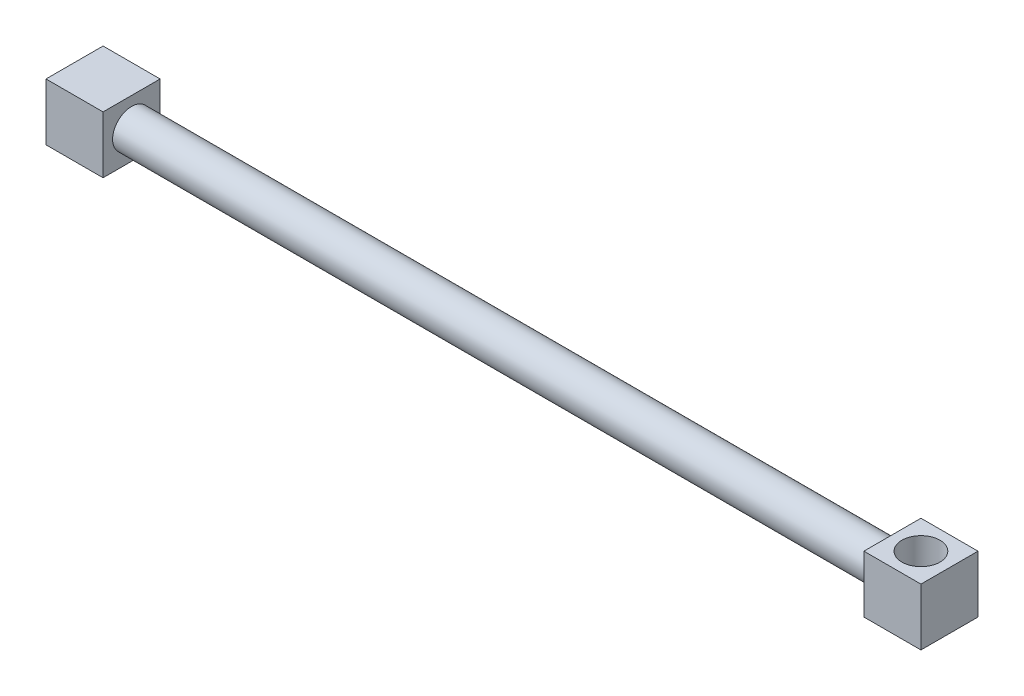
ISO-10303-21;
HEADER;
FILE_DESCRIPTION(('STEP AP214'),'2;1');
FILE_NAME('part.step','',(''),(''),'','','');
FILE_SCHEMA(('AUTOMOTIVE_DESIGN { 1 0 10303 214 1 1 1 1 }'));
ENDSEC;
DATA;
#1=APPLICATION_CONTEXT('core data for automotive mechanical design processes');
#2=APPLICATION_PROTOCOL_DEFINITION('international standard','automotive_design',2000,#1);
#3=PRODUCT_CONTEXT('',#1,'mechanical');
#4=PRODUCT('Part','Part','',(#3));
#5=PRODUCT_RELATED_PRODUCT_CATEGORY('part','',(#4));
#6=PRODUCT_DEFINITION_FORMATION('','',#4);
#7=PRODUCT_DEFINITION_CONTEXT('part definition',#1,'design');
#8=PRODUCT_DEFINITION('design','',#6,#7);
#9=PRODUCT_DEFINITION_SHAPE('','',#8);
#10=(LENGTH_UNIT() NAMED_UNIT(*) SI_UNIT(.MILLI.,.METRE.));
#11=(NAMED_UNIT(*) PLANE_ANGLE_UNIT() SI_UNIT($,.RADIAN.));
#12=(NAMED_UNIT(*) SI_UNIT($,.STERADIAN.) SOLID_ANGLE_UNIT());
#13=UNCERTAINTY_MEASURE_WITH_UNIT(LENGTH_MEASURE(1.E-05),#10,'distance_accuracy_value','');
#14=(GEOMETRIC_REPRESENTATION_CONTEXT(3) GLOBAL_UNCERTAINTY_ASSIGNED_CONTEXT((#13)) GLOBAL_UNIT_ASSIGNED_CONTEXT((#10,
#11,#12)) REPRESENTATION_CONTEXT('',''));
#15=CARTESIAN_POINT('',(0.,0.,0.));
#16=DIRECTION('',(0.,0.,1.));
#17=DIRECTION('',(1.,0.,0.));
#18=AXIS2_PLACEMENT_3D('',#15,#16,#17);
#19=CARTESIAN_POINT('',(30.,15.,-15.));
#20=DIRECTION('',(0.,0.,1.));
#21=DIRECTION('',(0.,-1.,0.));
#22=AXIS2_PLACEMENT_3D('',#19,#20,#21);
#23=PLANE('',#22);
#24=DIRECTION('',(0.,1.,0.));
#25=VECTOR('',#24,1.);
#26=CARTESIAN_POINT('',(0.,15.,-15.));
#27=LINE('',#26,#25);
#28=CARTESIAN_POINT('',(0.,-15.,-15.));
#29=VERTEX_POINT('',#28);
#30=CARTESIAN_POINT('',(0.,15.,-15.));
#31=VERTEX_POINT('',#30);
#32=EDGE_CURVE('E149',#29,#31,#27,.T.);
#33=ORIENTED_EDGE('',*,*,#32,.T.);
#34=DIRECTION('',(-1.,0.,0.));
#35=VECTOR('',#34,1.);
#36=CARTESIAN_POINT('',(30.,15.,-15.));
#37=LINE('',#36,#35);
#38=CARTESIAN_POINT('',(30.,15.,-15.));
#39=VERTEX_POINT('',#38);
#40=EDGE_CURVE('E42',#39,#31,#37,.T.);
#41=ORIENTED_EDGE('',*,*,#40,.F.);
#42=DIRECTION('',(0.,1.,0.));
#43=VECTOR('',#42,1.);
#44=CARTESIAN_POINT('',(30.,15.,-15.));
#45=LINE('',#44,#43);
#46=CARTESIAN_POINT('',(30.,-15.,-15.));
#47=VERTEX_POINT('',#46);
#48=EDGE_CURVE('E155',#47,#39,#45,.T.);
#49=ORIENTED_EDGE('',*,*,#48,.F.);
#50=DIRECTION('',(-1.,0.,0.));
#51=VECTOR('',#50,1.);
#52=CARTESIAN_POINT('',(30.,-15.,-15.));
#53=LINE('',#52,#51);
#54=EDGE_CURVE('E165',#47,#29,#53,.T.);
#55=ORIENTED_EDGE('',*,*,#54,.T.);
#56=EDGE_LOOP('',(#33,#41,#49,#55));
#57=FACE_BOUND('',#56,.T.);
#58=ADVANCED_FACE('F39',(#57),#23,.F.);
#59=CARTESIAN_POINT('',(30.,15.,15.));
#60=DIRECTION('',(0.,-1.,0.));
#61=DIRECTION('',(0.,0.,-1.));
#62=AXIS2_PLACEMENT_3D('',#59,#60,#61);
#63=PLANE('',#62);
#64=DIRECTION('',(0.,0.,1.));
#65=VECTOR('',#64,1.);
#66=CARTESIAN_POINT('',(0.,15.,15.));
#67=LINE('',#66,#65);
#68=CARTESIAN_POINT('',(0.,15.,15.));
#69=VERTEX_POINT('',#68);
#70=EDGE_CURVE('E169',#31,#69,#67,.T.);
#71=ORIENTED_EDGE('',*,*,#70,.T.);
#72=DIRECTION('',(-1.,0.,0.));
#73=VECTOR('',#72,1.);
#74=CARTESIAN_POINT('',(30.,15.,15.));
#75=LINE('',#74,#73);
#76=CARTESIAN_POINT('',(30.,15.,15.));
#77=VERTEX_POINT('',#76);
#78=EDGE_CURVE('E180',#77,#69,#75,.T.);
#79=ORIENTED_EDGE('',*,*,#78,.F.);
#80=DIRECTION('',(0.,0.,1.));
#81=VECTOR('',#80,1.);
#82=CARTESIAN_POINT('',(30.,15.,15.));
#83=LINE('',#82,#81);
#84=EDGE_CURVE('E89',#39,#77,#83,.T.);
#85=ORIENTED_EDGE('',*,*,#84,.F.);
#86=ORIENTED_EDGE('',*,*,#40,.T.);
#87=EDGE_LOOP('',(#71,#79,#85,#86));
#88=FACE_BOUND('',#87,.T.);
#89=ADVANCED_FACE('F185',(#88),#63,.F.);
#90=CARTESIAN_POINT('',(30.,15.,15.));
#91=DIRECTION('',(0.,0.,-1.));
#92=DIRECTION('',(0.,1.,0.));
#93=AXIS2_PLACEMENT_3D('',#90,#91,#92);
#94=PLANE('',#93);
#95=DIRECTION('',(0.,-1.,0.));
#96=VECTOR('',#95,1.);
#97=CARTESIAN_POINT('',(0.,15.,15.));
#98=LINE('',#97,#96);
#99=CARTESIAN_POINT('',(0.,-15.,15.));
#100=VERTEX_POINT('',#99);
#101=EDGE_CURVE('E75',#69,#100,#98,.T.);
#102=ORIENTED_EDGE('',*,*,#101,.T.);
#103=DIRECTION('',(-1.,0.,0.));
#104=VECTOR('',#103,1.);
#105=CARTESIAN_POINT('',(30.,-15.,15.));
#106=LINE('',#105,#104);
#107=CARTESIAN_POINT('',(30.,-15.,15.));
#108=VERTEX_POINT('',#107);
#109=EDGE_CURVE('E178',#108,#100,#106,.T.);
#110=ORIENTED_EDGE('',*,*,#109,.F.);
#111=DIRECTION('',(0.,-1.,0.));
#112=VECTOR('',#111,1.);
#113=CARTESIAN_POINT('',(30.,15.,15.));
#114=LINE('',#113,#112);
#115=EDGE_CURVE('E160',#77,#108,#114,.T.);
#116=ORIENTED_EDGE('',*,*,#115,.F.);
#117=ORIENTED_EDGE('',*,*,#78,.T.);
#118=EDGE_LOOP('',(#102,#110,#116,#117));
#119=FACE_BOUND('',#118,.T.);
#120=ADVANCED_FACE('F209',(#119),#94,.F.);
#121=CARTESIAN_POINT('',(30.,-15.,15.));
#122=DIRECTION('',(0.,1.,0.));
#123=DIRECTION('',(0.,0.,1.));
#124=AXIS2_PLACEMENT_3D('',#121,#122,#123);
#125=PLANE('',#124);
#126=DIRECTION('',(0.,0.,-1.));
#127=VECTOR('',#126,1.);
#128=CARTESIAN_POINT('',(0.,-15.,15.));
#129=LINE('',#128,#127);
#130=EDGE_CURVE('E81',#100,#29,#129,.T.);
#131=ORIENTED_EDGE('',*,*,#130,.T.);
#132=ORIENTED_EDGE('',*,*,#54,.F.);
#133=DIRECTION('',(0.,0.,-1.));
#134=VECTOR('',#133,1.);
#135=CARTESIAN_POINT('',(30.,-15.,15.));
#136=LINE('',#135,#134);
#137=EDGE_CURVE('E57',#108,#47,#136,.T.);
#138=ORIENTED_EDGE('',*,*,#137,.F.);
#139=ORIENTED_EDGE('',*,*,#109,.T.);
#140=EDGE_LOOP('',(#131,#132,#138,#139));
#141=FACE_BOUND('',#140,.T.);
#142=ADVANCED_FACE('F201',(#141),#125,.F.);
#143=CARTESIAN_POINT('',(30.,0.,0.));
#144=DIRECTION('',(1.,0.,0.));
#145=DIRECTION('',(0.,0.,-1.));
#146=AXIS2_PLACEMENT_3D('',#143,#144,#145);
#147=PLANE('',#146);
#148=CARTESIAN_POINT('',(30.,0.,0.));
#149=DIRECTION('',(1.,0.,0.));
#150=DIRECTION('',(0.,0.,-1.));
#151=AXIS2_PLACEMENT_3D('',#148,#149,#150);
#152=CIRCLE('',#151,10.);
#153=CARTESIAN_POINT('',(30.,0.,-10.));
#154=VERTEX_POINT('',#153);
#155=EDGE_CURVE('E11',#154,#154,#152,.T.);
#156=ORIENTED_EDGE('',*,*,#155,.F.);
#157=EDGE_LOOP('',(#156));
#158=FACE_BOUND('',#157,.T.);
#159=ORIENTED_EDGE('',*,*,#48,.T.);
#160=ORIENTED_EDGE('',*,*,#84,.T.);
#161=ORIENTED_EDGE('',*,*,#115,.T.);
#162=ORIENTED_EDGE('',*,*,#137,.T.);
#163=EDGE_LOOP('',(#159,#160,#161,#162));
#164=FACE_BOUND('',#163,.T.);
#165=ADVANCED_FACE('F193',(#158,#164),#147,.T.);
#166=CARTESIAN_POINT('',(0.,0.,0.));
#167=DIRECTION('',(1.,0.,0.));
#168=DIRECTION('',(0.,0.,-1.));
#169=AXIS2_PLACEMENT_3D('',#166,#167,#168);
#170=PLANE('',#169);
#171=ORIENTED_EDGE('',*,*,#32,.F.);
#172=ORIENTED_EDGE('',*,*,#130,.F.);
#173=ORIENTED_EDGE('',*,*,#101,.F.);
#174=ORIENTED_EDGE('',*,*,#70,.F.);
#175=EDGE_LOOP('',(#171,#172,#173,#174));
#176=FACE_BOUND('',#175,.T.);
#177=ADVANCED_FACE('F190',(#176),#170,.F.);
#178=CARTESIAN_POINT('',(430.,0.,0.));
#179=DIRECTION('',(-1.,0.,0.));
#180=DIRECTION('',(0.,0.,1.));
#181=AXIS2_PLACEMENT_3D('',#178,#179,#180);
#182=CYLINDRICAL_SURFACE('',#181,10.);
#183=CARTESIAN_POINT('',(430.,0.,0.));
#184=DIRECTION('',(1.,0.,0.));
#185=DIRECTION('',(0.,0.,-1.));
#186=AXIS2_PLACEMENT_3D('',#183,#184,#185);
#187=CIRCLE('',#186,10.);
#188=CARTESIAN_POINT('',(430.,0.,-10.));
#189=VERTEX_POINT('',#188);
#190=EDGE_CURVE('E144',#189,#189,#187,.T.);
#191=ORIENTED_EDGE('',*,*,#190,.F.);
#192=EDGE_LOOP('',(#191));
#193=FACE_BOUND('',#192,.T.);
#194=ORIENTED_EDGE('',*,*,#155,.T.);
#195=EDGE_LOOP('',(#194));
#196=FACE_BOUND('',#195,.T.);
#197=ADVANCED_FACE('F192',(#193,#196),#182,.T.);
#198=CARTESIAN_POINT('',(460.,-15.,-15.));
#199=DIRECTION('',(0.,0.,1.));
#200=DIRECTION('',(1.,0.,0.));
#201=AXIS2_PLACEMENT_3D('',#198,#199,#200);
#202=PLANE('',#201);
#203=DIRECTION('',(0.,1.,0.));
#204=VECTOR('',#203,1.);
#205=CARTESIAN_POINT('',(430.,-15.,-15.));
#206=LINE('',#205,#204);
#207=CARTESIAN_POINT('',(430.,-15.,-15.));
#208=VERTEX_POINT('',#207);
#209=CARTESIAN_POINT('',(430.,15.,-15.));
#210=VERTEX_POINT('',#209);
#211=EDGE_CURVE('E142',#208,#210,#206,.T.);
#212=ORIENTED_EDGE('',*,*,#211,.T.);
#213=DIRECTION('',(-1.,0.,0.));
#214=VECTOR('',#213,1.);
#215=CARTESIAN_POINT('',(460.,15.,-15.));
#216=LINE('',#215,#214);
#217=CARTESIAN_POINT('',(460.,15.,-15.));
#218=VERTEX_POINT('',#217);
#219=EDGE_CURVE('E120',#218,#210,#216,.T.);
#220=ORIENTED_EDGE('',*,*,#219,.F.);
#221=DIRECTION('',(0.,1.,0.));
#222=VECTOR('',#221,1.);
#223=CARTESIAN_POINT('',(460.,-15.,-15.));
#224=LINE('',#223,#222);
#225=CARTESIAN_POINT('',(460.,-15.,-15.));
#226=VERTEX_POINT('',#225);
#227=EDGE_CURVE('E128',#226,#218,#224,.T.);
#228=ORIENTED_EDGE('',*,*,#227,.F.);
#229=DIRECTION('',(-1.,0.,0.));
#230=VECTOR('',#229,1.);
#231=CARTESIAN_POINT('',(460.,-15.,-15.));
#232=LINE('',#231,#230);
#233=EDGE_CURVE('E316',#226,#208,#232,.T.);
#234=ORIENTED_EDGE('',*,*,#233,.T.);
#235=EDGE_LOOP('',(#212,#220,#228,#234));
#236=FACE_BOUND('',#235,.T.);
#237=ADVANCED_FACE('F140',(#236),#202,.F.);
#238=CARTESIAN_POINT('',(460.,15.,15.));
#239=DIRECTION('',(0.,-1.,0.));
#240=DIRECTION('',(0.,0.,-1.));
#241=AXIS2_PLACEMENT_3D('',#238,#239,#240);
#242=PLANE('',#241);
#243=CARTESIAN_POINT('',(445.,15.,0.));
#244=DIRECTION('',(0.,1.,0.));
#245=DIRECTION('',(0.,0.,1.));
#246=AXIS2_PLACEMENT_3D('',#243,#244,#245);
#247=CIRCLE('',#246,9.99999999999998);
#248=CARTESIAN_POINT('',(445.,15.,9.99999999999998));
#249=VERTEX_POINT('',#248);
#250=EDGE_CURVE('E306',#249,#249,#247,.T.);
#251=ORIENTED_EDGE('',*,*,#250,.F.);
#252=EDGE_LOOP('',(#251));
#253=FACE_BOUND('',#252,.T.);
#254=DIRECTION('',(0.,0.,1.));
#255=VECTOR('',#254,1.);
#256=CARTESIAN_POINT('',(430.,15.,15.));
#257=LINE('',#256,#255);
#258=CARTESIAN_POINT('',(430.,15.,15.));
#259=VERTEX_POINT('',#258);
#260=EDGE_CURVE('E319',#210,#259,#257,.T.);
#261=ORIENTED_EDGE('',*,*,#260,.T.);
#262=DIRECTION('',(-1.,0.,0.));
#263=VECTOR('',#262,1.);
#264=CARTESIAN_POINT('',(460.,15.,15.));
#265=LINE('',#264,#263);
#266=CARTESIAN_POINT('',(460.,15.,15.));
#267=VERTEX_POINT('',#266);
#268=EDGE_CURVE('E123',#267,#259,#265,.T.);
#269=ORIENTED_EDGE('',*,*,#268,.F.);
#270=DIRECTION('',(0.,0.,1.));
#271=VECTOR('',#270,1.);
#272=CARTESIAN_POINT('',(460.,15.,15.));
#273=LINE('',#272,#271);
#274=EDGE_CURVE('E116',#218,#267,#273,.T.);
#275=ORIENTED_EDGE('',*,*,#274,.F.);
#276=ORIENTED_EDGE('',*,*,#219,.T.);
#277=EDGE_LOOP('',(#261,#269,#275,#276));
#278=FACE_BOUND('',#277,.T.);
#279=ADVANCED_FACE('F118',(#253,#278),#242,.F.);
#280=CARTESIAN_POINT('',(460.,-15.,15.));
#281=DIRECTION('',(0.,0.,-1.));
#282=DIRECTION('',(-1.,0.,0.));
#283=AXIS2_PLACEMENT_3D('',#280,#281,#282);
#284=PLANE('',#283);
#285=DIRECTION('',(0.,-1.,0.));
#286=VECTOR('',#285,1.);
#287=CARTESIAN_POINT('',(430.,-15.,15.));
#288=LINE('',#287,#286);
#289=CARTESIAN_POINT('',(430.,-15.,15.));
#290=VERTEX_POINT('',#289);
#291=EDGE_CURVE('E322',#259,#290,#288,.T.);
#292=ORIENTED_EDGE('',*,*,#291,.T.);
#293=DIRECTION('',(-1.,0.,0.));
#294=VECTOR('',#293,1.);
#295=CARTESIAN_POINT('',(460.,-15.,15.));
#296=LINE('',#295,#294);
#297=CARTESIAN_POINT('',(460.,-15.,15.));
#298=VERTEX_POINT('',#297);
#299=EDGE_CURVE('E151',#298,#290,#296,.T.);
#300=ORIENTED_EDGE('',*,*,#299,.F.);
#301=DIRECTION('',(0.,-1.,0.));
#302=VECTOR('',#301,1.);
#303=CARTESIAN_POINT('',(460.,-15.,15.));
#304=LINE('',#303,#302);
#305=EDGE_CURVE('E127',#267,#298,#304,.T.);
#306=ORIENTED_EDGE('',*,*,#305,.F.);
#307=ORIENTED_EDGE('',*,*,#268,.T.);
#308=EDGE_LOOP('',(#292,#300,#306,#307));
#309=FACE_BOUND('',#308,.T.);
#310=ADVANCED_FACE('F246',(#309),#284,.F.);
#311=CARTESIAN_POINT('',(460.,-15.,15.));
#312=DIRECTION('',(0.,1.,0.));
#313=DIRECTION('',(0.,0.,1.));
#314=AXIS2_PLACEMENT_3D('',#311,#312,#313);
#315=PLANE('',#314);
#316=CARTESIAN_POINT('',(445.,-15.,0.));
#317=DIRECTION('',(0.,1.,0.));
#318=DIRECTION('',(0.,0.,1.));
#319=AXIS2_PLACEMENT_3D('',#316,#317,#318);
#320=CIRCLE('',#319,9.99999999999998);
#321=CARTESIAN_POINT('',(445.,-15.,9.99999999999998));
#322=VERTEX_POINT('',#321);
#323=EDGE_CURVE('E303',#322,#322,#320,.F.);
#324=ORIENTED_EDGE('',*,*,#323,.F.);
#325=EDGE_LOOP('',(#324));
#326=FACE_BOUND('',#325,.T.);
#327=DIRECTION('',(0.,0.,-1.));
#328=VECTOR('',#327,1.);
#329=CARTESIAN_POINT('',(430.,-15.,15.));
#330=LINE('',#329,#328);
#331=EDGE_CURVE('E138',#290,#208,#330,.T.);
#332=ORIENTED_EDGE('',*,*,#331,.T.);
#333=ORIENTED_EDGE('',*,*,#233,.F.);
#334=DIRECTION('',(0.,0.,-1.));
#335=VECTOR('',#334,1.);
#336=CARTESIAN_POINT('',(460.,-15.,15.));
#337=LINE('',#336,#335);
#338=EDGE_CURVE('E133',#298,#226,#337,.T.);
#339=ORIENTED_EDGE('',*,*,#338,.F.);
#340=ORIENTED_EDGE('',*,*,#299,.T.);
#341=EDGE_LOOP('',(#332,#333,#339,#340));
#342=FACE_BOUND('',#341,.T.);
#343=ADVANCED_FACE('F251',(#326,#342),#315,.F.);
#344=CARTESIAN_POINT('',(460.,0.,0.));
#345=DIRECTION('',(-1.,0.,0.));
#346=DIRECTION('',(0.,0.,1.));
#347=AXIS2_PLACEMENT_3D('',#344,#345,#346);
#348=PLANE('',#347);
#349=ORIENTED_EDGE('',*,*,#227,.T.);
#350=ORIENTED_EDGE('',*,*,#274,.T.);
#351=ORIENTED_EDGE('',*,*,#305,.T.);
#352=ORIENTED_EDGE('',*,*,#338,.T.);
#353=EDGE_LOOP('',(#349,#350,#351,#352));
#354=FACE_BOUND('',#353,.T.);
#355=ADVANCED_FACE('F131',(#354),#348,.F.);
#356=CARTESIAN_POINT('',(430.,0.,0.));
#357=DIRECTION('',(-1.,0.,0.));
#358=DIRECTION('',(0.,0.,1.));
#359=AXIS2_PLACEMENT_3D('',#356,#357,#358);
#360=PLANE('',#359);
#361=ORIENTED_EDGE('',*,*,#190,.T.);
#362=EDGE_LOOP('',(#361));
#363=FACE_BOUND('',#362,.T.);
#364=ORIENTED_EDGE('',*,*,#211,.F.);
#365=ORIENTED_EDGE('',*,*,#331,.F.);
#366=ORIENTED_EDGE('',*,*,#291,.F.);
#367=ORIENTED_EDGE('',*,*,#260,.F.);
#368=EDGE_LOOP('',(#364,#365,#366,#367));
#369=FACE_BOUND('',#368,.T.);
#370=ADVANCED_FACE('F263',(#363,#369),#360,.T.);
#371=CARTESIAN_POINT('',(445.,-43.2842712474619,0.));
#372=DIRECTION('',(0.,1.,0.));
#373=DIRECTION('',(0.,0.,1.));
#374=AXIS2_PLACEMENT_3D('',#371,#372,#373);
#375=CYLINDRICAL_SURFACE('',#374,9.99999999999998);
#376=ORIENTED_EDGE('',*,*,#323,.T.);
#377=EDGE_LOOP('',(#376));
#378=FACE_BOUND('',#377,.T.);
#379=ORIENTED_EDGE('',*,*,#250,.T.);
#380=EDGE_LOOP('',(#379));
#381=FACE_BOUND('',#380,.T.);
#382=ADVANCED_FACE('F272',(#378,#381),#375,.F.);
#383=CLOSED_SHELL('',(#58,#89,#120,#142,#165,#177,#197,#237,#279,#310,#343,#355,#370,#382));
#384=MANIFOLD_SOLID_BREP('B2',#383);
#385=ADVANCED_BREP_SHAPE_REPRESENTATION('',(#18,#384),#14);
#386=SHAPE_DEFINITION_REPRESENTATION(#9,#385);
ENDSEC;
END-ISO-10303-21;
